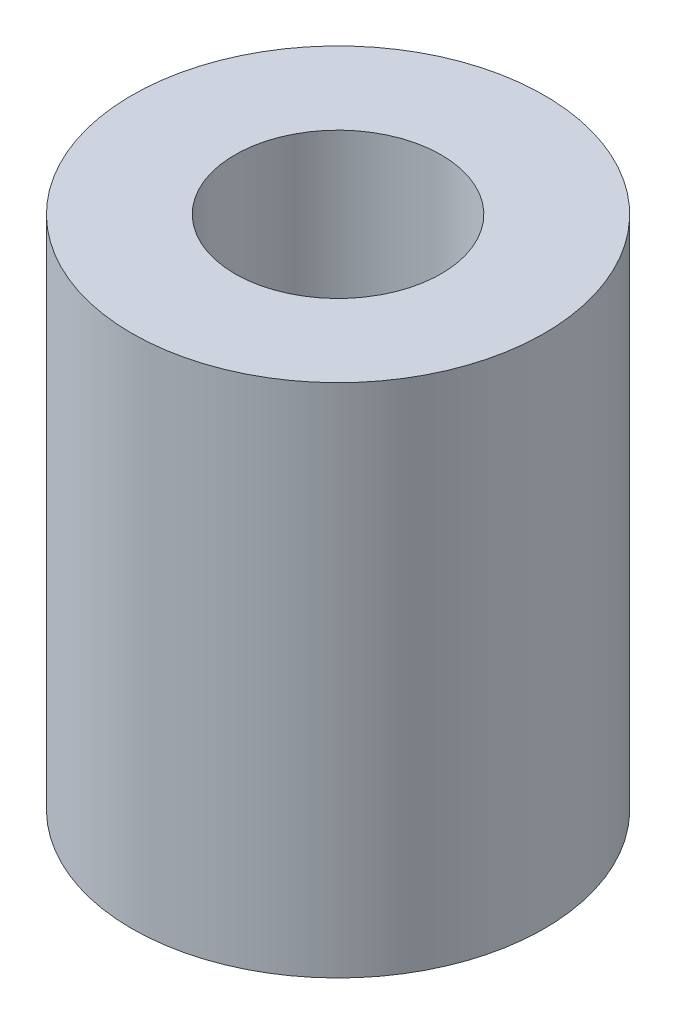
ISO-10303-21;
HEADER;
FILE_DESCRIPTION(('STEP AP214'),'2;1');
FILE_NAME('part.step','',(''),(''),'','','');
FILE_SCHEMA(('AUTOMOTIVE_DESIGN { 1 0 10303 214 1 1 1 1 }'));
ENDSEC;
DATA;
#1=APPLICATION_CONTEXT('core data for automotive mechanical design processes');
#2=APPLICATION_PROTOCOL_DEFINITION('international standard','automotive_design',2000,#1);
#3=PRODUCT_CONTEXT('',#1,'mechanical');
#4=PRODUCT('Part','Part','',(#3));
#5=PRODUCT_RELATED_PRODUCT_CATEGORY('part','',(#4));
#6=PRODUCT_DEFINITION_FORMATION('','',#4);
#7=PRODUCT_DEFINITION_CONTEXT('part definition',#1,'design');
#8=PRODUCT_DEFINITION('design','',#6,#7);
#9=PRODUCT_DEFINITION_SHAPE('','',#8);
#10=(LENGTH_UNIT() NAMED_UNIT(*) SI_UNIT(.MILLI.,.METRE.));
#11=(NAMED_UNIT(*) PLANE_ANGLE_UNIT() SI_UNIT($,.RADIAN.));
#12=(NAMED_UNIT(*) SI_UNIT($,.STERADIAN.) SOLID_ANGLE_UNIT());
#13=UNCERTAINTY_MEASURE_WITH_UNIT(LENGTH_MEASURE(1.E-05),#10,'distance_accuracy_value','');
#14=(GEOMETRIC_REPRESENTATION_CONTEXT(3) GLOBAL_UNCERTAINTY_ASSIGNED_CONTEXT((#13)) GLOBAL_UNIT_ASSIGNED_CONTEXT((#10,
#11,#12)) REPRESENTATION_CONTEXT('',''));
#15=CARTESIAN_POINT('',(0.,0.,0.));
#16=DIRECTION('',(0.,0.,1.));
#17=DIRECTION('',(1.,0.,0.));
#18=AXIS2_PLACEMENT_3D('',#15,#16,#17);
#19=CARTESIAN_POINT('',(0.,10.,0.));
#20=DIRECTION('',(0.,1.,0.));
#21=DIRECTION('',(0.,0.,1.));
#22=AXIS2_PLACEMENT_3D('',#19,#20,#21);
#23=PLANE('',#22);
#24=CARTESIAN_POINT('',(0.,10.,0.));
#25=DIRECTION('',(0.,1.,0.));
#26=DIRECTION('',(0.,0.,1.));
#27=AXIS2_PLACEMENT_3D('',#24,#25,#26);
#28=CIRCLE('',#27,4.);
#29=CARTESIAN_POINT('',(0.,10.,4.));
#30=VERTEX_POINT('',#29);
#31=EDGE_CURVE('E10',#30,#30,#28,.T.);
#32=ORIENTED_EDGE('',*,*,#31,.T.);
#33=EDGE_LOOP('',(#32));
#34=FACE_BOUND('',#33,.T.);
#35=CARTESIAN_POINT('',(0.,10.,0.));
#36=DIRECTION('',(0.,1.,0.));
#37=DIRECTION('',(0.,0.,1.));
#38=AXIS2_PLACEMENT_3D('',#35,#36,#37);
#39=CIRCLE('',#38,2.);
#40=CARTESIAN_POINT('',(0.,10.,2.));
#41=VERTEX_POINT('',#40);
#42=EDGE_CURVE('E46',#41,#41,#39,.T.);
#43=ORIENTED_EDGE('',*,*,#42,.F.);
#44=EDGE_LOOP('',(#43));
#45=FACE_BOUND('',#44,.T.);
#46=ADVANCED_FACE('F35',(#34,#45),#23,.T.);
#47=CARTESIAN_POINT('',(0.,0.,0.));
#48=DIRECTION('',(0.,1.,0.));
#49=DIRECTION('',(0.,0.,1.));
#50=AXIS2_PLACEMENT_3D('',#47,#48,#49);
#51=PLANE('',#50);
#52=CARTESIAN_POINT('',(0.,0.,0.));
#53=DIRECTION('',(0.,1.,0.));
#54=DIRECTION('',(0.,0.,1.));
#55=AXIS2_PLACEMENT_3D('',#52,#53,#54);
#56=CIRCLE('',#55,4.);
#57=CARTESIAN_POINT('',(0.,0.,4.));
#58=VERTEX_POINT('',#57);
#59=EDGE_CURVE('E39',#58,#58,#56,.T.);
#60=ORIENTED_EDGE('',*,*,#59,.F.);
#61=EDGE_LOOP('',(#60));
#62=FACE_BOUND('',#61,.T.);
#63=CARTESIAN_POINT('',(0.,0.,0.));
#64=DIRECTION('',(0.,1.,0.));
#65=DIRECTION('',(0.,0.,1.));
#66=AXIS2_PLACEMENT_3D('',#63,#64,#65);
#67=CIRCLE('',#66,2.);
#68=CARTESIAN_POINT('',(0.,0.,2.));
#69=VERTEX_POINT('',#68);
#70=EDGE_CURVE('E48',#69,#69,#67,.T.);
#71=ORIENTED_EDGE('',*,*,#70,.T.);
#72=EDGE_LOOP('',(#71));
#73=FACE_BOUND('',#72,.T.);
#74=ADVANCED_FACE('F58',(#62,#73),#51,.F.);
#75=CARTESIAN_POINT('',(0.,10.,0.));
#76=DIRECTION('',(0.,-1.,0.));
#77=DIRECTION('',(0.,0.,-1.));
#78=AXIS2_PLACEMENT_3D('',#75,#76,#77);
#79=CYLINDRICAL_SURFACE('',#78,4.);
#80=ORIENTED_EDGE('',*,*,#31,.F.);
#81=EDGE_LOOP('',(#80));
#82=FACE_BOUND('',#81,.T.);
#83=ORIENTED_EDGE('',*,*,#59,.T.);
#84=EDGE_LOOP('',(#83));
#85=FACE_BOUND('',#84,.T.);
#86=ADVANCED_FACE('F37',(#82,#85),#79,.T.);
#87=CARTESIAN_POINT('',(0.,10.,0.));
#88=DIRECTION('',(0.,-1.,0.));
#89=DIRECTION('',(0.,0.,-1.));
#90=AXIS2_PLACEMENT_3D('',#87,#88,#89);
#91=CYLINDRICAL_SURFACE('',#90,2.);
#92=ORIENTED_EDGE('',*,*,#42,.T.);
#93=EDGE_LOOP('',(#92));
#94=FACE_BOUND('',#93,.T.);
#95=ORIENTED_EDGE('',*,*,#70,.F.);
#96=EDGE_LOOP('',(#95));
#97=FACE_BOUND('',#96,.T.);
#98=ADVANCED_FACE('F54',(#94,#97),#91,.F.);
#99=CLOSED_SHELL('',(#46,#74,#86,#98));
#100=MANIFOLD_SOLID_BREP('B2',#99);
#101=ADVANCED_BREP_SHAPE_REPRESENTATION('',(#18,#100),#14);
#102=SHAPE_DEFINITION_REPRESENTATION(#9,#101);
ENDSEC;
END-ISO-10303-21;
